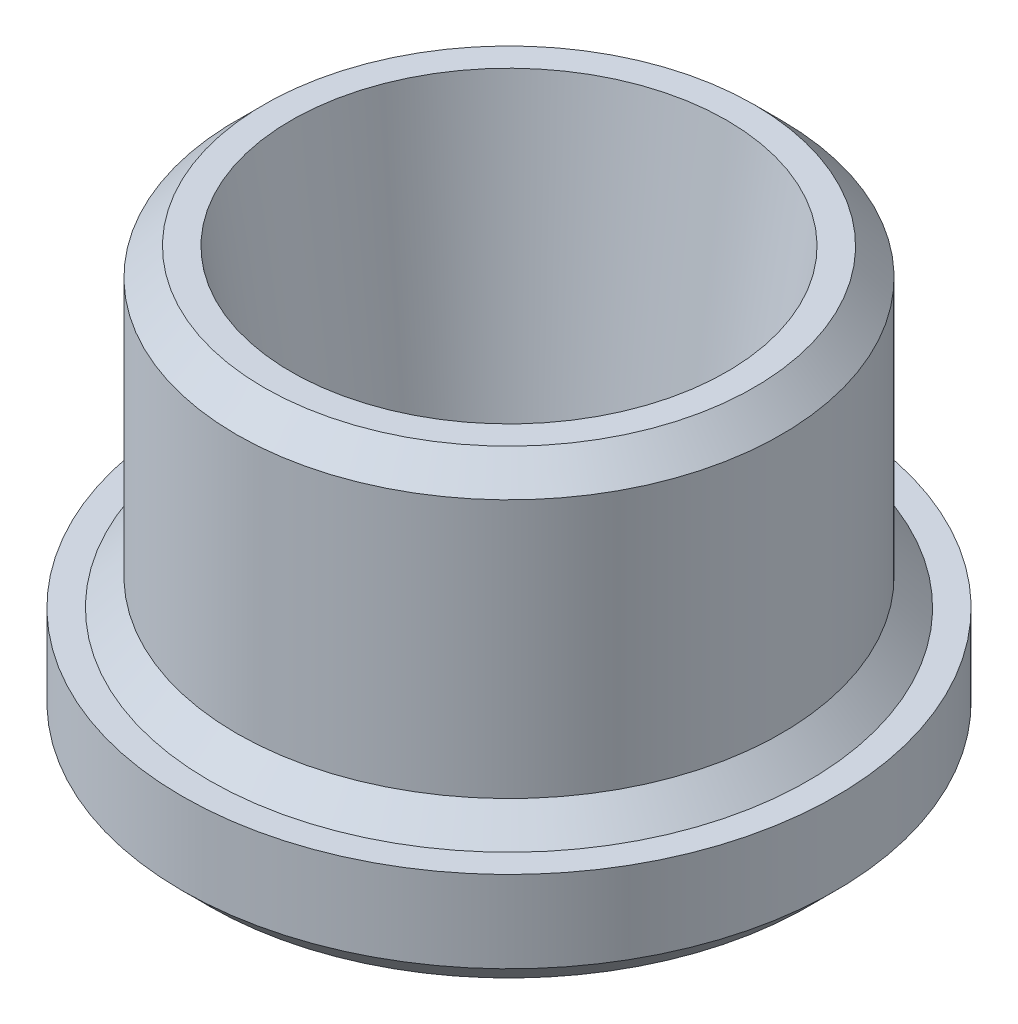
ISO-10303-21;
HEADER;
FILE_DESCRIPTION(('STEP AP214'),'2;1');
FILE_NAME('part.step','',(''),(''),'','','');
FILE_SCHEMA(('AUTOMOTIVE_DESIGN { 1 0 10303 214 1 1 1 1 }'));
ENDSEC;
DATA;
#1=APPLICATION_CONTEXT('core data for automotive mechanical design processes');
#2=APPLICATION_PROTOCOL_DEFINITION('international standard','automotive_design',2000,#1);
#3=PRODUCT_CONTEXT('',#1,'mechanical');
#4=PRODUCT('Part','Part','',(#3));
#5=PRODUCT_RELATED_PRODUCT_CATEGORY('part','',(#4));
#6=PRODUCT_DEFINITION_FORMATION('','',#4);
#7=PRODUCT_DEFINITION_CONTEXT('part definition',#1,'design');
#8=PRODUCT_DEFINITION('design','',#6,#7);
#9=PRODUCT_DEFINITION_SHAPE('','',#8);
#10=(LENGTH_UNIT() NAMED_UNIT(*) SI_UNIT(.MILLI.,.METRE.));
#11=(NAMED_UNIT(*) PLANE_ANGLE_UNIT() SI_UNIT($,.RADIAN.));
#12=(NAMED_UNIT(*) SI_UNIT($,.STERADIAN.) SOLID_ANGLE_UNIT());
#13=UNCERTAINTY_MEASURE_WITH_UNIT(LENGTH_MEASURE(1.E-05),#10,'distance_accuracy_value','');
#14=(GEOMETRIC_REPRESENTATION_CONTEXT(3) GLOBAL_UNCERTAINTY_ASSIGNED_CONTEXT((#13)) GLOBAL_UNIT_ASSIGNED_CONTEXT((#10,
#11,#12)) REPRESENTATION_CONTEXT('',''));
#15=CARTESIAN_POINT('',(0.,0.,0.));
#16=DIRECTION('',(0.,0.,1.));
#17=DIRECTION('',(1.,0.,0.));
#18=AXIS2_PLACEMENT_3D('',#15,#16,#17);
#19=CARTESIAN_POINT('',(0.,-36.9602680378014,0.));
#20=DIRECTION('',(0.,-1.,0.));
#21=DIRECTION('',(0.,0.,-1.));
#22=AXIS2_PLACEMENT_3D('',#19,#20,#21);
#23=CYLINDRICAL_SURFACE('',#22,3.15);
#24=CARTESIAN_POINT('',(0.,0.,0.));
#25=DIRECTION('',(0.,-1.,0.));
#26=DIRECTION('',(0.,0.,-1.));
#27=AXIS2_PLACEMENT_3D('',#24,#25,#26);
#28=CIRCLE('',#27,3.15);
#29=CARTESIAN_POINT('',(0.,0.,-3.15));
#30=VERTEX_POINT('',#29);
#31=EDGE_CURVE('E50',#30,#30,#28,.T.);
#32=ORIENTED_EDGE('',*,*,#31,.T.);
#33=EDGE_LOOP('',(#32));
#34=FACE_BOUND('',#33,.T.);
#35=CARTESIAN_POINT('',(0.,1.75,0.));
#36=DIRECTION('',(0.,-1.,0.));
#37=DIRECTION('',(0.,0.,-1.));
#38=AXIS2_PLACEMENT_3D('',#35,#36,#37);
#39=CIRCLE('',#38,3.15);
#40=CARTESIAN_POINT('',(0.,1.75,-3.15));
#41=VERTEX_POINT('',#40);
#42=EDGE_CURVE('E65',#41,#41,#39,.T.);
#43=ORIENTED_EDGE('',*,*,#42,.F.);
#44=EDGE_LOOP('',(#43));
#45=FACE_BOUND('',#44,.T.);
#46=ADVANCED_FACE('F30',(#34,#45),#23,.F.);
#47=CARTESIAN_POINT('',(3.15,0.,0.));
#48=DIRECTION('',(0.,-1.,0.));
#49=DIRECTION('',(0.,0.,-1.));
#50=AXIS2_PLACEMENT_3D('',#47,#48,#49);
#51=PLANE('',#50);
#52=CARTESIAN_POINT('',(0.,0.,0.));
#53=DIRECTION('',(0.,-1.,0.));
#54=DIRECTION('',(0.,0.,-1.));
#55=AXIS2_PLACEMENT_3D('',#52,#53,#54);
#56=CIRCLE('',#55,5.5);
#57=CARTESIAN_POINT('',(0.,0.,-5.5));
#58=VERTEX_POINT('',#57);
#59=EDGE_CURVE('E45',#58,#58,#56,.T.);
#60=ORIENTED_EDGE('',*,*,#59,.T.);
#61=EDGE_LOOP('',(#60));
#62=FACE_BOUND('',#61,.T.);
#63=ORIENTED_EDGE('',*,*,#31,.F.);
#64=EDGE_LOOP('',(#63));
#65=FACE_BOUND('',#64,.T.);
#66=ADVANCED_FACE('F73',(#62,#65),#51,.T.);
#67=CARTESIAN_POINT('',(0.,-36.9602680378014,0.));
#68=DIRECTION('',(0.,-1.,0.));
#69=DIRECTION('',(0.,0.,-1.));
#70=AXIS2_PLACEMENT_3D('',#67,#68,#69);
#71=CYLINDRICAL_SURFACE('',#70,6.);
#72=CARTESIAN_POINT('',(0.,0.5,0.));
#73=DIRECTION('',(0.,-1.,0.));
#74=DIRECTION('',(0.,0.,-1.));
#75=AXIS2_PLACEMENT_3D('',#72,#73,#74);
#76=CIRCLE('',#75,6.);
#77=CARTESIAN_POINT('',(0.,0.5,-6.));
#78=VERTEX_POINT('',#77);
#79=EDGE_CURVE('E41',#78,#78,#76,.F.);
#80=ORIENTED_EDGE('',*,*,#79,.T.);
#81=EDGE_LOOP('',(#80));
#82=FACE_BOUND('',#81,.T.);
#83=CARTESIAN_POINT('',(0.,2.,0.));
#84=DIRECTION('',(0.,-1.,0.));
#85=DIRECTION('',(0.,0.,-1.));
#86=AXIS2_PLACEMENT_3D('',#83,#84,#85);
#87=CIRCLE('',#86,6.);
#88=CARTESIAN_POINT('',(0.,2.,-6.));
#89=VERTEX_POINT('',#88);
#90=EDGE_CURVE('E53',#89,#89,#87,.T.);
#91=ORIENTED_EDGE('',*,*,#90,.T.);
#92=EDGE_LOOP('',(#91));
#93=FACE_BOUND('',#92,.T.);
#94=ADVANCED_FACE('F79',(#82,#93),#71,.T.);
#95=CARTESIAN_POINT('',(6.,2.,0.));
#96=DIRECTION('',(0.,1.,0.));
#97=DIRECTION('',(0.,0.,1.));
#98=AXIS2_PLACEMENT_3D('',#95,#96,#97);
#99=PLANE('',#98);
#100=CARTESIAN_POINT('',(0.,2.,0.));
#101=DIRECTION('',(0.,-1.,0.));
#102=DIRECTION('',(0.,0.,-1.));
#103=AXIS2_PLACEMENT_3D('',#100,#101,#102);
#104=CIRCLE('',#103,5.5);
#105=CARTESIAN_POINT('',(0.,2.,-5.5));
#106=VERTEX_POINT('',#105);
#107=EDGE_CURVE('E56',#106,#106,#104,.T.);
#108=ORIENTED_EDGE('',*,*,#107,.T.);
#109=EDGE_LOOP('',(#108));
#110=FACE_BOUND('',#109,.T.);
#111=ORIENTED_EDGE('',*,*,#90,.F.);
#112=EDGE_LOOP('',(#111));
#113=FACE_BOUND('',#112,.T.);
#114=ADVANCED_FACE('F101',(#110,#113),#99,.T.);
#115=CARTESIAN_POINT('',(0.,2.,0.));
#116=DIRECTION('',(0.,-1.,0.));
#117=DIRECTION('',(0.,0.,-1.));
#118=AXIS2_PLACEMENT_3D('',#115,#116,#117);
#119=CONICAL_SURFACE('',#118,5.5,0.785398163397448);
#120=CARTESIAN_POINT('',(0.,2.5,0.));
#121=DIRECTION('',(0.,-1.,0.));
#122=DIRECTION('',(0.,0.,-1.));
#123=AXIS2_PLACEMENT_3D('',#120,#121,#122);
#124=CIRCLE('',#123,5.);
#125=CARTESIAN_POINT('',(0.,2.5,-5.));
#126=VERTEX_POINT('',#125);
#127=EDGE_CURVE('E59',#126,#126,#124,.T.);
#128=ORIENTED_EDGE('',*,*,#127,.T.);
#129=EDGE_LOOP('',(#128));
#130=FACE_BOUND('',#129,.T.);
#131=ORIENTED_EDGE('',*,*,#107,.F.);
#132=EDGE_LOOP('',(#131));
#133=FACE_BOUND('',#132,.T.);
#134=ADVANCED_FACE('F105',(#130,#133),#119,.T.);
#135=CARTESIAN_POINT('',(0.,-36.9602680378014,0.));
#136=DIRECTION('',(0.,-1.,0.));
#137=DIRECTION('',(0.,0.,-1.));
#138=AXIS2_PLACEMENT_3D('',#135,#136,#137);
#139=CYLINDRICAL_SURFACE('',#138,5.);
#140=CARTESIAN_POINT('',(0.,7.24999999999999,0.));
#141=DIRECTION('',(0.,1.,0.));
#142=DIRECTION('',(0.,0.,1.));
#143=AXIS2_PLACEMENT_3D('',#140,#141,#142);
#144=CIRCLE('',#143,5.);
#145=CARTESIAN_POINT('',(0.,7.24999999999999,5.));
#146=VERTEX_POINT('',#145);
#147=EDGE_CURVE('E37',#146,#146,#144,.F.);
#148=ORIENTED_EDGE('',*,*,#147,.T.);
#149=EDGE_LOOP('',(#148));
#150=FACE_BOUND('',#149,.T.);
#151=ORIENTED_EDGE('',*,*,#127,.F.);
#152=EDGE_LOOP('',(#151));
#153=FACE_BOUND('',#152,.T.);
#154=ADVANCED_FACE('F111',(#150,#153),#139,.T.);
#155=CARTESIAN_POINT('',(5.,7.75,0.));
#156=DIRECTION('',(0.,1.,0.));
#157=DIRECTION('',(0.,0.,1.));
#158=AXIS2_PLACEMENT_3D('',#155,#156,#157);
#159=PLANE('',#158);
#160=CARTESIAN_POINT('',(0.,7.75,0.));
#161=DIRECTION('',(0.,1.,0.));
#162=DIRECTION('',(0.,0.,1.));
#163=AXIS2_PLACEMENT_3D('',#160,#161,#162);
#164=CIRCLE('',#163,4.49999999999999);
#165=CARTESIAN_POINT('',(0.,7.75,4.49999999999999));
#166=VERTEX_POINT('',#165);
#167=EDGE_CURVE('E10',#166,#166,#164,.T.);
#168=ORIENTED_EDGE('',*,*,#167,.T.);
#169=EDGE_LOOP('',(#168));
#170=FACE_BOUND('',#169,.T.);
#171=CARTESIAN_POINT('',(0.,7.75,0.));
#172=DIRECTION('',(0.,-1.,0.));
#173=DIRECTION('',(0.,0.,-1.));
#174=AXIS2_PLACEMENT_3D('',#171,#172,#173);
#175=CIRCLE('',#174,4.);
#176=CARTESIAN_POINT('',(0.,7.75,-4.));
#177=VERTEX_POINT('',#176);
#178=EDGE_CURVE('E62',#177,#177,#175,.T.);
#179=ORIENTED_EDGE('',*,*,#178,.T.);
#180=EDGE_LOOP('',(#179));
#181=FACE_BOUND('',#180,.T.);
#182=ADVANCED_FACE('F91',(#170,#181),#159,.T.);
#183=CARTESIAN_POINT('',(0.,7.75,0.));
#184=DIRECTION('',(0.,1.,0.));
#185=DIRECTION('',(0.,0.,1.));
#186=AXIS2_PLACEMENT_3D('',#183,#184,#185);
#187=CONICAL_SURFACE('',#186,4.,0.140730193990225);
#188=ORIENTED_EDGE('',*,*,#42,.T.);
#189=EDGE_LOOP('',(#188));
#190=FACE_BOUND('',#189,.T.);
#191=ORIENTED_EDGE('',*,*,#178,.F.);
#192=EDGE_LOOP('',(#191));
#193=FACE_BOUND('',#192,.T.);
#194=ADVANCED_FACE('F69',(#190,#193),#187,.F.);
#195=CARTESIAN_POINT('',(0.,0.,0.));
#196=DIRECTION('',(0.,1.,0.));
#197=DIRECTION('',(0.,0.,1.));
#198=AXIS2_PLACEMENT_3D('',#195,#196,#197);
#199=CONICAL_SURFACE('',#198,5.5,0.785398163397445);
#200=ORIENTED_EDGE('',*,*,#79,.F.);
#201=EDGE_LOOP('',(#200));
#202=FACE_BOUND('',#201,.T.);
#203=ORIENTED_EDGE('',*,*,#59,.F.);
#204=EDGE_LOOP('',(#203));
#205=FACE_BOUND('',#204,.T.);
#206=ADVANCED_FACE('F83',(#202,#205),#199,.T.);
#207=CARTESIAN_POINT('',(0.,7.24999999999999,0.));
#208=DIRECTION('',(0.,-1.,0.));
#209=DIRECTION('',(0.,0.,-1.));
#210=AXIS2_PLACEMENT_3D('',#207,#208,#209);
#211=CONICAL_SURFACE('',#210,5.,0.785398163397448);
#212=ORIENTED_EDGE('',*,*,#167,.F.);
#213=EDGE_LOOP('',(#212));
#214=FACE_BOUND('',#213,.T.);
#215=ORIENTED_EDGE('',*,*,#147,.F.);
#216=EDGE_LOOP('',(#215));
#217=FACE_BOUND('',#216,.T.);
#218=ADVANCED_FACE('F32',(#214,#217),#211,.T.);
#219=CLOSED_SHELL('',(#46,#66,#94,#114,#134,#154,#182,#194,#206,#218));
#220=MANIFOLD_SOLID_BREP('B2',#219);
#221=ADVANCED_BREP_SHAPE_REPRESENTATION('',(#18,#220),#14);
#222=SHAPE_DEFINITION_REPRESENTATION(#9,#221);
ENDSEC;
END-ISO-10303-21;
